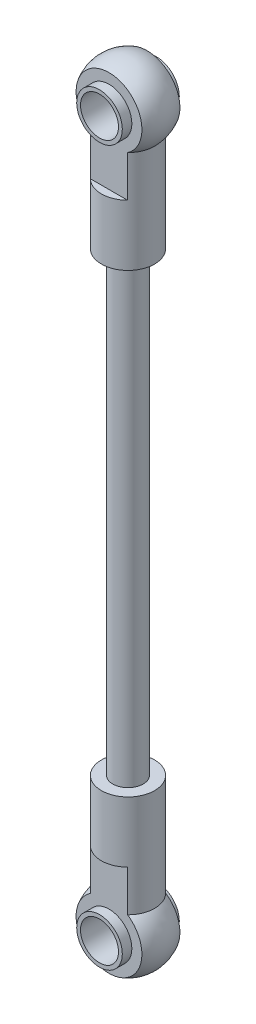
ISO-10303-21;
HEADER;
FILE_DESCRIPTION(('STEP AP214'),'2;1');
FILE_NAME('part.step','',(''),(''),'','','');
FILE_SCHEMA(('AUTOMOTIVE_DESIGN { 1 0 10303 214 1 1 1 1 }'));
ENDSEC;
DATA;
#1=APPLICATION_CONTEXT('core data for automotive mechanical design processes');
#2=APPLICATION_PROTOCOL_DEFINITION('international standard','automotive_design',2000,#1);
#3=PRODUCT_CONTEXT('',#1,'mechanical');
#4=PRODUCT('Part','Part','',(#3));
#5=PRODUCT_RELATED_PRODUCT_CATEGORY('part','',(#4));
#6=PRODUCT_DEFINITION_FORMATION('','',#4);
#7=PRODUCT_DEFINITION_CONTEXT('part definition',#1,'design');
#8=PRODUCT_DEFINITION('design','',#6,#7);
#9=PRODUCT_DEFINITION_SHAPE('','',#8);
#10=(LENGTH_UNIT() NAMED_UNIT(*) SI_UNIT(.MILLI.,.METRE.));
#11=(NAMED_UNIT(*) PLANE_ANGLE_UNIT() SI_UNIT($,.RADIAN.));
#12=(NAMED_UNIT(*) SI_UNIT($,.STERADIAN.) SOLID_ANGLE_UNIT());
#13=UNCERTAINTY_MEASURE_WITH_UNIT(LENGTH_MEASURE(1.E-05),#10,'distance_accuracy_value','');
#14=(GEOMETRIC_REPRESENTATION_CONTEXT(3) GLOBAL_UNCERTAINTY_ASSIGNED_CONTEXT((#13)) GLOBAL_UNIT_ASSIGNED_CONTEXT((#10,
#11,#12)) REPRESENTATION_CONTEXT('',''));
#15=CARTESIAN_POINT('',(0.,0.,0.));
#16=DIRECTION('',(0.,0.,1.));
#17=DIRECTION('',(1.,0.,0.));
#18=AXIS2_PLACEMENT_3D('',#15,#16,#17);
#19=CARTESIAN_POINT('',(0.,0.,2.5));
#20=DIRECTION('',(0.,0.,-1.));
#21=DIRECTION('',(-1.,0.,0.));
#22=AXIS2_PLACEMENT_3D('',#19,#20,#21);
#23=PLANE('',#22);
#24=CARTESIAN_POINT('',(0.,0.,2.5));
#25=DIRECTION('',(0.,0.,-1.));
#26=DIRECTION('',(-1.,0.,0.));
#27=AXIS2_PLACEMENT_3D('',#24,#25,#26);
#28=CIRCLE('',#27,4.33012701892219);
#29=CARTESIAN_POINT('',(-2.44948974278318,-3.57071421427142,2.5));
#30=VERTEX_POINT('',#29);
#31=CARTESIAN_POINT('',(2.44948974278318,-3.57071421427142,2.5));
#32=VERTEX_POINT('',#31);
#33=EDGE_CURVE('E65',#30,#32,#28,.T.);
#34=ORIENTED_EDGE('',*,*,#33,.F.);
#35=DIRECTION('',(0.,-1.,0.));
#36=VECTOR('',#35,1.);
#37=CARTESIAN_POINT('',(-2.44948974278318,0.,2.5));
#38=LINE('',#37,#36);
#39=CARTESIAN_POINT('',(-2.44948974278318,-9.,2.5));
#40=VERTEX_POINT('',#39);
#41=EDGE_CURVE('E203',#40,#30,#38,.F.);
#42=ORIENTED_EDGE('',*,*,#41,.F.);
#43=DIRECTION('',(1.,0.,0.));
#44=VECTOR('',#43,1.);
#45=CARTESIAN_POINT('',(-6.,-9.,2.5));
#46=LINE('',#45,#44);
#47=CARTESIAN_POINT('',(2.44948974278318,-9.,2.5));
#48=VERTEX_POINT('',#47);
#49=EDGE_CURVE('E200',#40,#48,#46,.T.);
#50=ORIENTED_EDGE('',*,*,#49,.T.);
#51=DIRECTION('',(0.,-1.,0.));
#52=VECTOR('',#51,1.);
#53=CARTESIAN_POINT('',(2.44948974278318,0.,2.5));
#54=LINE('',#53,#52);
#55=EDGE_CURVE('E206',#32,#48,#54,.T.);
#56=ORIENTED_EDGE('',*,*,#55,.F.);
#57=EDGE_LOOP('',(#34,#42,#50,#56));
#58=FACE_BOUND('',#57,.T.);
#59=CARTESIAN_POINT('',(0.,0.,2.5));
#60=DIRECTION('',(0.,0.,-1.));
#61=DIRECTION('',(-1.,0.,0.));
#62=AXIS2_PLACEMENT_3D('',#59,#60,#61);
#63=CIRCLE('',#62,3.);
#64=CARTESIAN_POINT('',(-3.,0.,2.5));
#65=VERTEX_POINT('',#64);
#66=EDGE_CURVE('E51',#65,#65,#63,.F.);
#67=ORIENTED_EDGE('',*,*,#66,.F.);
#68=EDGE_LOOP('',(#67));
#69=FACE_BOUND('',#68,.T.);
#70=ADVANCED_FACE('F42',(#58,#69),#23,.F.);
#71=CARTESIAN_POINT('',(0.,0.,-2.5));
#72=DIRECTION('',(0.,0.,1.));
#73=DIRECTION('',(-1.,0.,0.));
#74=AXIS2_PLACEMENT_3D('',#71,#72,#73);
#75=PLANE('',#74);
#76=CARTESIAN_POINT('',(0.,0.,-2.5));
#77=DIRECTION('',(0.,0.,1.));
#78=DIRECTION('',(1.,0.,0.));
#79=AXIS2_PLACEMENT_3D('',#76,#77,#78);
#80=CIRCLE('',#79,4.33012701892219);
#81=CARTESIAN_POINT('',(2.44948974278318,-3.57071421427142,-2.5));
#82=VERTEX_POINT('',#81);
#83=CARTESIAN_POINT('',(-2.44948974278318,-3.57071421427142,-2.5));
#84=VERTEX_POINT('',#83);
#85=EDGE_CURVE('E192',#82,#84,#80,.T.);
#86=ORIENTED_EDGE('',*,*,#85,.F.);
#87=DIRECTION('',(0.,-1.,0.));
#88=VECTOR('',#87,1.);
#89=CARTESIAN_POINT('',(2.44948974278318,0.,-2.5));
#90=LINE('',#89,#88);
#91=CARTESIAN_POINT('',(2.44948974278318,-9.,-2.5));
#92=VERTEX_POINT('',#91);
#93=EDGE_CURVE('E189',#92,#82,#90,.F.);
#94=ORIENTED_EDGE('',*,*,#93,.F.);
#95=DIRECTION('',(1.,0.,0.));
#96=VECTOR('',#95,1.);
#97=CARTESIAN_POINT('',(-6.,-9.,-2.5));
#98=LINE('',#97,#96);
#99=CARTESIAN_POINT('',(-2.44948974278318,-9.,-2.5));
#100=VERTEX_POINT('',#99);
#101=EDGE_CURVE('E57',#100,#92,#98,.T.);
#102=ORIENTED_EDGE('',*,*,#101,.F.);
#103=DIRECTION('',(0.,-1.,0.));
#104=VECTOR('',#103,1.);
#105=CARTESIAN_POINT('',(-2.44948974278318,0.,-2.5));
#106=LINE('',#105,#104);
#107=EDGE_CURVE('E195',#84,#100,#106,.T.);
#108=ORIENTED_EDGE('',*,*,#107,.F.);
#109=EDGE_LOOP('',(#86,#94,#102,#108));
#110=FACE_BOUND('',#109,.T.);
#111=CARTESIAN_POINT('',(0.,0.,-2.5));
#112=DIRECTION('',(0.,0.,1.));
#113=DIRECTION('',(1.,0.,0.));
#114=AXIS2_PLACEMENT_3D('',#111,#112,#113);
#115=CIRCLE('',#114,3.);
#116=CARTESIAN_POINT('',(3.,0.,-2.5));
#117=VERTEX_POINT('',#116);
#118=EDGE_CURVE('E185',#117,#117,#115,.F.);
#119=ORIENTED_EDGE('',*,*,#118,.F.);
#120=EDGE_LOOP('',(#119));
#121=FACE_BOUND('',#120,.T.);
#122=ADVANCED_FACE('F223',(#110,#121),#75,.F.);
#123=CARTESIAN_POINT('',(0.,0.,0.));
#124=DIRECTION('',(0.,-1.,0.));
#125=DIRECTION('',(1.,0.,0.));
#126=AXIS2_PLACEMENT_3D('',#123,#124,#125);
#127=SPHERICAL_SURFACE('',#126,5.);
#128=ORIENTED_EDGE('',*,*,#85,.T.);
#129=CARTESIAN_POINT('',(0.,-3.57071421427142,0.));
#130=DIRECTION('',(0.,-1.,0.));
#131=DIRECTION('',(0.,0.,-1.));
#132=AXIS2_PLACEMENT_3D('',#129,#130,#131);
#133=CIRCLE('',#132,3.5);
#134=EDGE_CURVE('E210',#30,#84,#133,.T.);
#135=ORIENTED_EDGE('',*,*,#134,.F.);
#136=ORIENTED_EDGE('',*,*,#33,.T.);
#137=EDGE_CURVE('E209',#82,#32,#133,.T.);
#138=ORIENTED_EDGE('',*,*,#137,.F.);
#139=EDGE_LOOP('',(#128,#135,#136,#138));
#140=FACE_BOUND('',#139,.T.);
#141=ADVANCED_FACE('F44',(#140),#127,.T.);
#142=CARTESIAN_POINT('',(1.75,-17.,0.));
#143=DIRECTION('',(0.,-1.,0.));
#144=DIRECTION('',(0.,0.,-1.));
#145=AXIS2_PLACEMENT_3D('',#142,#143,#144);
#146=PLANE('',#145);
#147=CARTESIAN_POINT('',(0.,-17.,0.));
#148=DIRECTION('',(0.,-1.,0.));
#149=DIRECTION('',(0.,0.,-1.));
#150=AXIS2_PLACEMENT_3D('',#147,#148,#149);
#151=CIRCLE('',#150,2.);
#152=CARTESIAN_POINT('',(0.,-17.,-2.));
#153=VERTEX_POINT('',#152);
#154=EDGE_CURVE('E165',#153,#153,#151,.T.);
#155=ORIENTED_EDGE('',*,*,#154,.F.);
#156=EDGE_LOOP('',(#155));
#157=FACE_BOUND('',#156,.T.);
#158=CARTESIAN_POINT('',(0.,-17.,0.));
#159=DIRECTION('',(0.,-1.,0.));
#160=DIRECTION('',(0.,0.,-1.));
#161=AXIS2_PLACEMENT_3D('',#158,#159,#160);
#162=CIRCLE('',#161,3.5);
#163=CARTESIAN_POINT('',(0.,-17.,-3.5));
#164=VERTEX_POINT('',#163);
#165=EDGE_CURVE('E213',#164,#164,#162,.T.);
#166=ORIENTED_EDGE('',*,*,#165,.T.);
#167=EDGE_LOOP('',(#166));
#168=FACE_BOUND('',#167,.T.);
#169=ADVANCED_FACE('F231',(#157,#168),#146,.T.);
#170=CARTESIAN_POINT('',(0.,0.,0.));
#171=DIRECTION('',(0.,-1.,0.));
#172=DIRECTION('',(0.,0.,-1.));
#173=AXIS2_PLACEMENT_3D('',#170,#171,#172);
#174=CYLINDRICAL_SURFACE('',#173,3.5);
#175=ORIENTED_EDGE('',*,*,#107,.T.);
#176=CARTESIAN_POINT('',(0.,-9.,0.));
#177=DIRECTION('',(0.,-1.,0.));
#178=DIRECTION('',(0.,0.,-1.));
#179=AXIS2_PLACEMENT_3D('',#176,#177,#178);
#180=CIRCLE('',#179,3.5);
#181=EDGE_CURVE('E180',#100,#92,#180,.T.);
#182=ORIENTED_EDGE('',*,*,#181,.T.);
#183=ORIENTED_EDGE('',*,*,#93,.T.);
#184=ORIENTED_EDGE('',*,*,#137,.T.);
#185=ORIENTED_EDGE('',*,*,#55,.T.);
#186=CARTESIAN_POINT('',(0.,-9.,0.));
#187=DIRECTION('',(0.,1.,0.));
#188=DIRECTION('',(0.,0.,1.));
#189=AXIS2_PLACEMENT_3D('',#186,#187,#188);
#190=CIRCLE('',#189,3.5);
#191=EDGE_CURVE('E198',#40,#48,#190,.T.);
#192=ORIENTED_EDGE('',*,*,#191,.F.);
#193=ORIENTED_EDGE('',*,*,#41,.T.);
#194=ORIENTED_EDGE('',*,*,#134,.T.);
#195=EDGE_LOOP('',(#175,#182,#183,#184,#185,#192,#193,#194));
#196=FACE_BOUND('',#195,.T.);
#197=ORIENTED_EDGE('',*,*,#165,.F.);
#198=EDGE_LOOP('',(#197));
#199=FACE_BOUND('',#198,.T.);
#200=ADVANCED_FACE('F244',(#196,#199),#174,.T.);
#201=CARTESIAN_POINT('',(-6.,-9.,4.33112701892219));
#202=DIRECTION('',(0.,1.,0.));
#203=DIRECTION('',(0.,0.,1.));
#204=AXIS2_PLACEMENT_3D('',#201,#202,#203);
#205=PLANE('',#204);
#206=ORIENTED_EDGE('',*,*,#191,.T.);
#207=ORIENTED_EDGE('',*,*,#49,.F.);
#208=EDGE_LOOP('',(#206,#207));
#209=FACE_BOUND('',#208,.T.);
#210=ADVANCED_FACE('F240',(#209),#205,.T.);
#211=CARTESIAN_POINT('',(-6.,-9.,-4.33112701892219));
#212=DIRECTION('',(0.,-1.,0.));
#213=DIRECTION('',(0.,0.,-1.));
#214=AXIS2_PLACEMENT_3D('',#211,#212,#213);
#215=PLANE('',#214);
#216=ORIENTED_EDGE('',*,*,#101,.T.);
#217=ORIENTED_EDGE('',*,*,#181,.F.);
#218=EDGE_LOOP('',(#216,#217));
#219=FACE_BOUND('',#218,.T.);
#220=ADVANCED_FACE('F238',(#219),#215,.F.);
#221=CARTESIAN_POINT('',(0.,0.,3.75));
#222=DIRECTION('',(0.,0.,-1.));
#223=DIRECTION('',(-1.,0.,0.));
#224=AXIS2_PLACEMENT_3D('',#221,#222,#223);
#225=CYLINDRICAL_SURFACE('',#224,3.);
#226=CARTESIAN_POINT('',(0.,0.,-3.75));
#227=DIRECTION('',(0.,0.,1.));
#228=DIRECTION('',(1.,0.,0.));
#229=AXIS2_PLACEMENT_3D('',#226,#227,#228);
#230=CIRCLE('',#229,3.);
#231=CARTESIAN_POINT('',(3.,0.,-3.75));
#232=VERTEX_POINT('',#231);
#233=EDGE_CURVE('E174',#232,#232,#230,.T.);
#234=ORIENTED_EDGE('',*,*,#233,.T.);
#235=EDGE_LOOP('',(#234));
#236=FACE_BOUND('',#235,.T.);
#237=ORIENTED_EDGE('',*,*,#118,.T.);
#238=EDGE_LOOP('',(#237));
#239=FACE_BOUND('',#238,.T.);
#240=ADVANCED_FACE('F221',(#236,#239),#225,.T.);
#241=CARTESIAN_POINT('',(0.,0.,-3.75));
#242=DIRECTION('',(0.,0.,1.));
#243=DIRECTION('',(1.,0.,0.));
#244=AXIS2_PLACEMENT_3D('',#241,#242,#243);
#245=PLANE('',#244);
#246=ORIENTED_EDGE('',*,*,#233,.F.);
#247=EDGE_LOOP('',(#246));
#248=FACE_BOUND('',#247,.T.);
#249=CARTESIAN_POINT('',(0.,0.,-3.75));
#250=DIRECTION('',(0.,0.,1.));
#251=DIRECTION('',(1.,0.,0.));
#252=AXIS2_PLACEMENT_3D('',#249,#250,#251);
#253=CIRCLE('',#252,2.5);
#254=CARTESIAN_POINT('',(2.5,0.,-3.75));
#255=VERTEX_POINT('',#254);
#256=EDGE_CURVE('E170',#255,#255,#253,.T.);
#257=ORIENTED_EDGE('',*,*,#256,.T.);
#258=EDGE_LOOP('',(#257));
#259=FACE_BOUND('',#258,.T.);
#260=ADVANCED_FACE('F249',(#248,#259),#245,.F.);
#261=CARTESIAN_POINT('',(0.,0.,-5.));
#262=DIRECTION('',(0.,0.,1.));
#263=DIRECTION('',(1.,0.,0.));
#264=AXIS2_PLACEMENT_3D('',#261,#262,#263);
#265=CYLINDRICAL_SURFACE('',#264,2.5);
#266=ORIENTED_EDGE('',*,*,#256,.F.);
#267=EDGE_LOOP('',(#266));
#268=FACE_BOUND('',#267,.T.);
#269=CARTESIAN_POINT('',(0.,0.,3.75));
#270=DIRECTION('',(0.,0.,1.));
#271=DIRECTION('',(1.,0.,0.));
#272=AXIS2_PLACEMENT_3D('',#269,#270,#271);
#273=CIRCLE('',#272,2.5);
#274=CARTESIAN_POINT('',(2.5,0.,3.75));
#275=VERTEX_POINT('',#274);
#276=EDGE_CURVE('E171',#275,#275,#273,.T.);
#277=ORIENTED_EDGE('',*,*,#276,.T.);
#278=EDGE_LOOP('',(#277));
#279=FACE_BOUND('',#278,.T.);
#280=ADVANCED_FACE('F246',(#268,#279),#265,.F.);
#281=CARTESIAN_POINT('',(0.,0.,3.75));
#282=DIRECTION('',(0.,0.,1.));
#283=DIRECTION('',(1.,0.,0.));
#284=AXIS2_PLACEMENT_3D('',#281,#282,#283);
#285=CIRCLE('',#284,3.);
#286=CARTESIAN_POINT('',(3.,0.,3.75));
#287=VERTEX_POINT('',#286);
#288=EDGE_CURVE('E177',#287,#287,#285,.T.);
#289=ORIENTED_EDGE('',*,*,#288,.F.);
#290=EDGE_LOOP('',(#289));
#291=FACE_BOUND('',#290,.T.);
#292=ORIENTED_EDGE('',*,*,#66,.T.);
#293=EDGE_LOOP('',(#292));
#294=FACE_BOUND('',#293,.T.);
#295=ADVANCED_FACE('F236',(#291,#294),#225,.T.);
#296=CARTESIAN_POINT('',(0.,0.,3.75));
#297=DIRECTION('',(0.,0.,1.));
#298=DIRECTION('',(1.,0.,0.));
#299=AXIS2_PLACEMENT_3D('',#296,#297,#298);
#300=PLANE('',#299);
#301=ORIENTED_EDGE('',*,*,#288,.T.);
#302=EDGE_LOOP('',(#301));
#303=FACE_BOUND('',#302,.T.);
#304=ORIENTED_EDGE('',*,*,#276,.F.);
#305=EDGE_LOOP('',(#304));
#306=FACE_BOUND('',#305,.T.);
#307=ADVANCED_FACE('F298',(#303,#306),#300,.T.);
#308=CARTESIAN_POINT('',(0.,-77.,0.));
#309=DIRECTION('',(0.,1.,0.));
#310=DIRECTION('',(0.,0.,1.));
#311=AXIS2_PLACEMENT_3D('',#308,#309,#310);
#312=CYLINDRICAL_SURFACE('',#311,2.);
#313=CARTESIAN_POINT('',(0.,-77.,0.));
#314=DIRECTION('',(0.,-1.,0.));
#315=DIRECTION('',(0.,0.,-1.));
#316=AXIS2_PLACEMENT_3D('',#313,#314,#315);
#317=CIRCLE('',#316,2.);
#318=CARTESIAN_POINT('',(0.,-77.,-2.));
#319=VERTEX_POINT('',#318);
#320=EDGE_CURVE('E161',#319,#319,#317,.T.);
#321=ORIENTED_EDGE('',*,*,#320,.F.);
#322=EDGE_LOOP('',(#321));
#323=FACE_BOUND('',#322,.T.);
#324=ORIENTED_EDGE('',*,*,#154,.T.);
#325=EDGE_LOOP('',(#324));
#326=FACE_BOUND('',#325,.T.);
#327=ADVANCED_FACE('F294',(#323,#326),#312,.T.);
#328=CARTESIAN_POINT('',(0.,-94.,3.75));
#329=DIRECTION('',(0.,0.,1.));
#330=DIRECTION('',(1.,0.,0.));
#331=AXIS2_PLACEMENT_3D('',#328,#329,#330);
#332=PLANE('',#331);
#333=CARTESIAN_POINT('',(0.,-94.,3.75));
#334=DIRECTION('',(0.,0.,-1.));
#335=DIRECTION('',(1.,0.,0.));
#336=AXIS2_PLACEMENT_3D('',#333,#334,#335);
#337=CIRCLE('',#336,3.);
#338=CARTESIAN_POINT('',(3.,-94.,3.75));
#339=VERTEX_POINT('',#338);
#340=EDGE_CURVE('E548',#339,#339,#337,.T.);
#341=ORIENTED_EDGE('',*,*,#340,.F.);
#342=EDGE_LOOP('',(#341));
#343=FACE_BOUND('',#342,.T.);
#344=CARTESIAN_POINT('',(0.,-94.,3.75));
#345=DIRECTION('',(0.,0.,-1.));
#346=DIRECTION('',(1.,0.,0.));
#347=AXIS2_PLACEMENT_3D('',#344,#345,#346);
#348=CIRCLE('',#347,2.5);
#349=CARTESIAN_POINT('',(2.5,-94.,3.75));
#350=VERTEX_POINT('',#349);
#351=EDGE_CURVE('E554',#350,#350,#348,.T.);
#352=ORIENTED_EDGE('',*,*,#351,.T.);
#353=EDGE_LOOP('',(#352));
#354=FACE_BOUND('',#353,.T.);
#355=ADVANCED_FACE('F297',(#343,#354),#332,.T.);
#356=CARTESIAN_POINT('',(0.,-94.,3.75));
#357=DIRECTION('',(0.,0.,-1.));
#358=DIRECTION('',(-1.,0.,0.));
#359=AXIS2_PLACEMENT_3D('',#356,#357,#358);
#360=CYLINDRICAL_SURFACE('',#359,3.);
#361=ORIENTED_EDGE('',*,*,#340,.T.);
#362=EDGE_LOOP('',(#361));
#363=FACE_BOUND('',#362,.T.);
#364=CARTESIAN_POINT('',(0.,-94.,2.5));
#365=DIRECTION('',(0.,0.,1.));
#366=DIRECTION('',(-1.,0.,0.));
#367=AXIS2_PLACEMENT_3D('',#364,#365,#366);
#368=CIRCLE('',#367,3.);
#369=CARTESIAN_POINT('',(-3.,-94.,2.5));
#370=VERTEX_POINT('',#369);
#371=EDGE_CURVE('E160',#370,#370,#368,.F.);
#372=ORIENTED_EDGE('',*,*,#371,.F.);
#373=EDGE_LOOP('',(#372));
#374=FACE_BOUND('',#373,.T.);
#375=ADVANCED_FACE('F341',(#363,#374),#360,.T.);
#376=CARTESIAN_POINT('',(0.,-94.,-5.));
#377=DIRECTION('',(0.,0.,1.));
#378=DIRECTION('',(1.,0.,0.));
#379=AXIS2_PLACEMENT_3D('',#376,#377,#378);
#380=CYLINDRICAL_SURFACE('',#379,2.5);
#381=CARTESIAN_POINT('',(0.,-94.,-3.75));
#382=DIRECTION('',(0.,0.,-1.));
#383=DIRECTION('',(1.,0.,0.));
#384=AXIS2_PLACEMENT_3D('',#381,#382,#383);
#385=CIRCLE('',#384,2.5);
#386=CARTESIAN_POINT('',(2.5,-94.,-3.75));
#387=VERTEX_POINT('',#386);
#388=EDGE_CURVE('E556',#387,#387,#385,.T.);
#389=ORIENTED_EDGE('',*,*,#388,.T.);
#390=EDGE_LOOP('',(#389));
#391=FACE_BOUND('',#390,.T.);
#392=ORIENTED_EDGE('',*,*,#351,.F.);
#393=EDGE_LOOP('',(#392));
#394=FACE_BOUND('',#393,.T.);
#395=ADVANCED_FACE('F349',(#391,#394),#380,.F.);
#396=CARTESIAN_POINT('',(0.,-94.,-3.75));
#397=DIRECTION('',(0.,0.,1.));
#398=DIRECTION('',(1.,0.,0.));
#399=AXIS2_PLACEMENT_3D('',#396,#397,#398);
#400=PLANE('',#399);
#401=CARTESIAN_POINT('',(0.,-94.,-3.75));
#402=DIRECTION('',(0.,0.,-1.));
#403=DIRECTION('',(1.,0.,0.));
#404=AXIS2_PLACEMENT_3D('',#401,#402,#403);
#405=CIRCLE('',#404,3.);
#406=CARTESIAN_POINT('',(3.,-94.,-3.75));
#407=VERTEX_POINT('',#406);
#408=EDGE_CURVE('E546',#407,#407,#405,.T.);
#409=ORIENTED_EDGE('',*,*,#408,.T.);
#410=EDGE_LOOP('',(#409));
#411=FACE_BOUND('',#410,.T.);
#412=ORIENTED_EDGE('',*,*,#388,.F.);
#413=EDGE_LOOP('',(#412));
#414=FACE_BOUND('',#413,.T.);
#415=ADVANCED_FACE('F358',(#411,#414),#400,.F.);
#416=ORIENTED_EDGE('',*,*,#408,.F.);
#417=EDGE_LOOP('',(#416));
#418=FACE_BOUND('',#417,.T.);
#419=CARTESIAN_POINT('',(0.,-94.,-2.5));
#420=DIRECTION('',(0.,0.,-1.));
#421=DIRECTION('',(1.,0.,0.));
#422=AXIS2_PLACEMENT_3D('',#419,#420,#421);
#423=CIRCLE('',#422,3.);
#424=CARTESIAN_POINT('',(3.,-94.,-2.5));
#425=VERTEX_POINT('',#424);
#426=EDGE_CURVE('E157',#425,#425,#423,.F.);
#427=ORIENTED_EDGE('',*,*,#426,.F.);
#428=EDGE_LOOP('',(#427));
#429=FACE_BOUND('',#428,.T.);
#430=ADVANCED_FACE('F352',(#418,#429),#360,.T.);
#431=CARTESIAN_POINT('',(-6.,-85.,-4.33112701892219));
#432=DIRECTION('',(0.,1.,0.));
#433=DIRECTION('',(0.,0.,-1.));
#434=AXIS2_PLACEMENT_3D('',#431,#432,#433);
#435=PLANE('',#434);
#436=DIRECTION('',(1.,0.,0.));
#437=VECTOR('',#436,1.);
#438=CARTESIAN_POINT('',(-6.,-85.,-2.5));
#439=LINE('',#438,#437);
#440=CARTESIAN_POINT('',(-2.44948974278318,-85.,-2.5));
#441=VERTEX_POINT('',#440);
#442=CARTESIAN_POINT('',(2.44948974278318,-85.,-2.5));
#443=VERTEX_POINT('',#442);
#444=EDGE_CURVE('E138',#441,#443,#439,.T.);
#445=ORIENTED_EDGE('',*,*,#444,.F.);
#446=CARTESIAN_POINT('',(0.,-85.,0.));
#447=DIRECTION('',(0.,-1.,0.));
#448=DIRECTION('',(0.,0.,-1.));
#449=AXIS2_PLACEMENT_3D('',#446,#447,#448);
#450=CIRCLE('',#449,3.5);
#451=EDGE_CURVE('E127',#441,#443,#450,.T.);
#452=ORIENTED_EDGE('',*,*,#451,.T.);
#453=EDGE_LOOP('',(#445,#452));
#454=FACE_BOUND('',#453,.T.);
#455=ADVANCED_FACE('F373',(#454),#435,.F.);
#456=CARTESIAN_POINT('',(-6.,-85.,4.33112701892219));
#457=DIRECTION('',(0.,-1.,0.));
#458=DIRECTION('',(0.,0.,1.));
#459=AXIS2_PLACEMENT_3D('',#456,#457,#458);
#460=PLANE('',#459);
#461=CARTESIAN_POINT('',(0.,-85.,0.));
#462=DIRECTION('',(0.,1.,0.));
#463=DIRECTION('',(0.,0.,1.));
#464=AXIS2_PLACEMENT_3D('',#461,#462,#463);
#465=CIRCLE('',#464,3.5);
#466=CARTESIAN_POINT('',(-2.44948974278318,-85.,2.5));
#467=VERTEX_POINT('',#466);
#468=CARTESIAN_POINT('',(2.44948974278318,-85.,2.5));
#469=VERTEX_POINT('',#468);
#470=EDGE_CURVE('E131',#467,#469,#465,.T.);
#471=ORIENTED_EDGE('',*,*,#470,.F.);
#472=DIRECTION('',(1.,0.,0.));
#473=VECTOR('',#472,1.);
#474=CARTESIAN_POINT('',(-6.,-85.,2.5));
#475=LINE('',#474,#473);
#476=EDGE_CURVE('E143',#467,#469,#475,.T.);
#477=ORIENTED_EDGE('',*,*,#476,.T.);
#478=EDGE_LOOP('',(#471,#477));
#479=FACE_BOUND('',#478,.T.);
#480=ADVANCED_FACE('F380',(#479),#460,.T.);
#481=CARTESIAN_POINT('',(0.,-94.,0.));
#482=DIRECTION('',(0.,1.,0.));
#483=DIRECTION('',(0.,0.,-1.));
#484=AXIS2_PLACEMENT_3D('',#481,#482,#483);
#485=CYLINDRICAL_SURFACE('',#484,3.5);
#486=DIRECTION('',(0.,1.,0.));
#487=VECTOR('',#486,1.);
#488=CARTESIAN_POINT('',(-2.44948974278318,-94.,-2.5));
#489=LINE('',#488,#487);
#490=CARTESIAN_POINT('',(-2.44948974278318,-90.4292857857286,-2.5));
#491=VERTEX_POINT('',#490);
#492=EDGE_CURVE('E123',#491,#441,#489,.T.);
#493=ORIENTED_EDGE('',*,*,#492,.F.);
#494=CARTESIAN_POINT('',(0.,-90.4292857857286,0.));
#495=DIRECTION('',(0.,-1.,0.));
#496=DIRECTION('',(0.,0.,-1.));
#497=AXIS2_PLACEMENT_3D('',#494,#495,#496);
#498=CIRCLE('',#497,3.5);
#499=CARTESIAN_POINT('',(-2.44948974278318,-90.4292857857286,2.5));
#500=VERTEX_POINT('',#499);
#501=EDGE_CURVE('E109',#500,#491,#498,.T.);
#502=ORIENTED_EDGE('',*,*,#501,.F.);
#503=DIRECTION('',(0.,1.,0.));
#504=VECTOR('',#503,1.);
#505=CARTESIAN_POINT('',(-2.44948974278318,-94.,2.5));
#506=LINE('',#505,#504);
#507=EDGE_CURVE('E146',#467,#500,#506,.F.);
#508=ORIENTED_EDGE('',*,*,#507,.F.);
#509=ORIENTED_EDGE('',*,*,#470,.T.);
#510=DIRECTION('',(0.,1.,0.));
#511=VECTOR('',#510,1.);
#512=CARTESIAN_POINT('',(2.44948974278318,-94.,2.5));
#513=LINE('',#512,#511);
#514=CARTESIAN_POINT('',(2.44948974278318,-90.4292857857286,2.5));
#515=VERTEX_POINT('',#514);
#516=EDGE_CURVE('E149',#515,#469,#513,.T.);
#517=ORIENTED_EDGE('',*,*,#516,.F.);
#518=CARTESIAN_POINT('',(2.44948974278318,-90.4292857857286,-2.5));
#519=VERTEX_POINT('',#518);
#520=EDGE_CURVE('E120',#519,#515,#498,.T.);
#521=ORIENTED_EDGE('',*,*,#520,.F.);
#522=DIRECTION('',(0.,1.,0.));
#523=VECTOR('',#522,1.);
#524=CARTESIAN_POINT('',(2.44948974278318,-94.,-2.5));
#525=LINE('',#524,#523);
#526=EDGE_CURVE('E136',#443,#519,#525,.F.);
#527=ORIENTED_EDGE('',*,*,#526,.F.);
#528=ORIENTED_EDGE('',*,*,#451,.F.);
#529=EDGE_LOOP('',(#493,#502,#508,#509,#517,#521,#527,#528));
#530=FACE_BOUND('',#529,.T.);
#531=CARTESIAN_POINT('',(0.,-77.,0.));
#532=DIRECTION('',(0.,-1.,0.));
#533=DIRECTION('',(0.,0.,-1.));
#534=AXIS2_PLACEMENT_3D('',#531,#532,#533);
#535=CIRCLE('',#534,3.5);
#536=CARTESIAN_POINT('',(0.,-77.,-3.5));
#537=VERTEX_POINT('',#536);
#538=EDGE_CURVE('E119',#537,#537,#535,.T.);
#539=ORIENTED_EDGE('',*,*,#538,.T.);
#540=EDGE_LOOP('',(#539));
#541=FACE_BOUND('',#540,.T.);
#542=ADVANCED_FACE('F124',(#530,#541),#485,.T.);
#543=CARTESIAN_POINT('',(1.75,-77.,0.));
#544=DIRECTION('',(0.,1.,0.));
#545=DIRECTION('',(0.,0.,-1.));
#546=AXIS2_PLACEMENT_3D('',#543,#544,#545);
#547=PLANE('',#546);
#548=ORIENTED_EDGE('',*,*,#320,.T.);
#549=EDGE_LOOP('',(#548));
#550=FACE_BOUND('',#549,.T.);
#551=ORIENTED_EDGE('',*,*,#538,.F.);
#552=EDGE_LOOP('',(#551));
#553=FACE_BOUND('',#552,.T.);
#554=ADVANCED_FACE('F288',(#550,#553),#547,.T.);
#555=CARTESIAN_POINT('',(0.,-94.,0.));
#556=DIRECTION('',(0.,1.,0.));
#557=DIRECTION('',(1.,0.,0.));
#558=AXIS2_PLACEMENT_3D('',#555,#556,#557);
#559=SPHERICAL_SURFACE('',#558,5.);
#560=CARTESIAN_POINT('',(0.,-94.,-2.5));
#561=DIRECTION('',(0.,0.,-1.));
#562=DIRECTION('',(1.,0.,0.));
#563=AXIS2_PLACEMENT_3D('',#560,#561,#562);
#564=CIRCLE('',#563,4.33012701892219);
#565=EDGE_CURVE('E113',#519,#491,#564,.T.);
#566=ORIENTED_EDGE('',*,*,#565,.F.);
#567=ORIENTED_EDGE('',*,*,#520,.T.);
#568=CARTESIAN_POINT('',(0.,-94.,2.5));
#569=DIRECTION('',(0.,0.,1.));
#570=DIRECTION('',(-1.,0.,0.));
#571=AXIS2_PLACEMENT_3D('',#568,#569,#570);
#572=CIRCLE('',#571,4.33012701892219);
#573=EDGE_CURVE('E115',#500,#515,#572,.T.);
#574=ORIENTED_EDGE('',*,*,#573,.F.);
#575=ORIENTED_EDGE('',*,*,#501,.T.);
#576=EDGE_LOOP('',(#566,#567,#574,#575));
#577=FACE_BOUND('',#576,.T.);
#578=ADVANCED_FACE('F111',(#577),#559,.T.);
#579=CARTESIAN_POINT('',(0.,-94.,-2.5));
#580=DIRECTION('',(0.,0.,1.));
#581=DIRECTION('',(-1.,0.,0.));
#582=AXIS2_PLACEMENT_3D('',#579,#580,#581);
#583=PLANE('',#582);
#584=ORIENTED_EDGE('',*,*,#565,.T.);
#585=ORIENTED_EDGE('',*,*,#492,.T.);
#586=ORIENTED_EDGE('',*,*,#444,.T.);
#587=ORIENTED_EDGE('',*,*,#526,.T.);
#588=EDGE_LOOP('',(#584,#585,#586,#587));
#589=FACE_BOUND('',#588,.T.);
#590=ORIENTED_EDGE('',*,*,#426,.T.);
#591=EDGE_LOOP('',(#590));
#592=FACE_BOUND('',#591,.T.);
#593=ADVANCED_FACE('F134',(#589,#592),#583,.F.);
#594=CARTESIAN_POINT('',(0.,-94.,2.5));
#595=DIRECTION('',(0.,0.,-1.));
#596=DIRECTION('',(-1.,0.,0.));
#597=AXIS2_PLACEMENT_3D('',#594,#595,#596);
#598=PLANE('',#597);
#599=ORIENTED_EDGE('',*,*,#573,.T.);
#600=ORIENTED_EDGE('',*,*,#516,.T.);
#601=ORIENTED_EDGE('',*,*,#476,.F.);
#602=ORIENTED_EDGE('',*,*,#507,.T.);
#603=EDGE_LOOP('',(#599,#600,#601,#602));
#604=FACE_BOUND('',#603,.T.);
#605=ORIENTED_EDGE('',*,*,#371,.T.);
#606=EDGE_LOOP('',(#605));
#607=FACE_BOUND('',#606,.T.);
#608=ADVANCED_FACE('F410',(#604,#607),#598,.F.);
#609=CLOSED_SHELL('',(#70,#122,#141,#169,#200,#210,#220,#240,#260,#280,#295,#307,#327,#355,#375,
#395,#415,#430,#455,#480,#542,#554,#578,#593,#608));
#610=CARTESIAN_POINT('',(0.,-7.,0.));
#611=DIRECTION('',(0.,-1.,0.));
#612=DIRECTION('',(0.,0.,-1.));
#613=AXIS2_PLACEMENT_3D('',#610,#611,#612);
#614=PLANE('',#613);
#615=CARTESIAN_POINT('',(0.,-7.,0.));
#616=DIRECTION('',(0.,-1.,0.));
#617=DIRECTION('',(0.,0.,-1.));
#618=AXIS2_PLACEMENT_3D('',#615,#616,#617);
#619=CIRCLE('',#618,1.75);
#620=CARTESIAN_POINT('',(0.,-7.,-1.75));
#621=VERTEX_POINT('',#620);
#622=EDGE_CURVE('E216',#621,#621,#619,.T.);
#623=ORIENTED_EDGE('',*,*,#622,.T.);
#624=EDGE_LOOP('',(#623));
#625=FACE_BOUND('',#624,.T.);
#626=ADVANCED_FACE('F260',(#625),#614,.T.);
#627=CARTESIAN_POINT('',(0.,0.,0.));
#628=DIRECTION('',(0.,-1.,0.));
#629=DIRECTION('',(0.,0.,-1.));
#630=AXIS2_PLACEMENT_3D('',#627,#628,#629);
#631=CYLINDRICAL_SURFACE('',#630,1.75);
#632=CARTESIAN_POINT('',(0.,-17.,0.));
#633=DIRECTION('',(0.,-1.,0.));
#634=DIRECTION('',(0.,0.,-1.));
#635=AXIS2_PLACEMENT_3D('',#632,#633,#634);
#636=CIRCLE('',#635,1.75);
#637=CARTESIAN_POINT('',(0.,-17.,-1.75));
#638=VERTEX_POINT('',#637);
#639=EDGE_CURVE('E164',#638,#638,#636,.T.);
#640=ORIENTED_EDGE('',*,*,#639,.T.);
#641=EDGE_LOOP('',(#640));
#642=FACE_BOUND('',#641,.T.);
#643=ORIENTED_EDGE('',*,*,#622,.F.);
#644=EDGE_LOOP('',(#643));
#645=FACE_BOUND('',#644,.T.);
#646=ADVANCED_FACE('F257',(#642,#645),#631,.F.);
#647=CARTESIAN_POINT('',(0.,-17.,0.));
#648=DIRECTION('',(0.,-1.,0.));
#649=DIRECTION('',(0.,0.,-1.));
#650=AXIS2_PLACEMENT_3D('',#647,#648,#649);
#651=PLANE('',#650);
#652=ORIENTED_EDGE('',*,*,#639,.F.);
#653=EDGE_LOOP('',(#652));
#654=FACE_BOUND('',#653,.T.);
#655=ADVANCED_FACE('F259',(#654),#651,.F.);
#656=CLOSED_SHELL('',(#626,#646,#655));
#657=CARTESIAN_POINT('',(0.,-87.,0.));
#658=DIRECTION('',(0.,1.,0.));
#659=DIRECTION('',(0.,0.,-1.));
#660=AXIS2_PLACEMENT_3D('',#657,#658,#659);
#661=PLANE('',#660);
#662=CARTESIAN_POINT('',(0.,-87.,0.));
#663=DIRECTION('',(0.,-1.,0.));
#664=DIRECTION('',(0.,0.,-1.));
#665=AXIS2_PLACEMENT_3D('',#662,#663,#664);
#666=CIRCLE('',#665,1.75);
#667=CARTESIAN_POINT('',(0.,-87.,-1.75));
#668=VERTEX_POINT('',#667);
#669=EDGE_CURVE('E154',#668,#668,#666,.T.);
#670=ORIENTED_EDGE('',*,*,#669,.F.);
#671=EDGE_LOOP('',(#670));
#672=FACE_BOUND('',#671,.T.);
#673=ADVANCED_FACE('F271',(#672),#661,.T.);
#674=CARTESIAN_POINT('',(0.,-94.,0.));
#675=DIRECTION('',(0.,1.,0.));
#676=DIRECTION('',(0.,0.,-1.));
#677=AXIS2_PLACEMENT_3D('',#674,#675,#676);
#678=CYLINDRICAL_SURFACE('',#677,1.75);
#679=CARTESIAN_POINT('',(0.,-77.,0.));
#680=DIRECTION('',(0.,-1.,0.));
#681=DIRECTION('',(0.,0.,-1.));
#682=AXIS2_PLACEMENT_3D('',#679,#680,#681);
#683=CIRCLE('',#682,1.75);
#684=CARTESIAN_POINT('',(0.,-77.,-1.75));
#685=VERTEX_POINT('',#684);
#686=EDGE_CURVE('E12',#685,#685,#683,.F.);
#687=ORIENTED_EDGE('',*,*,#686,.T.);
#688=EDGE_LOOP('',(#687));
#689=FACE_BOUND('',#688,.T.);
#690=ORIENTED_EDGE('',*,*,#669,.T.);
#691=EDGE_LOOP('',(#690));
#692=FACE_BOUND('',#691,.T.);
#693=ADVANCED_FACE('F273',(#689,#692),#678,.F.);
#694=CARTESIAN_POINT('',(0.,-77.,0.));
#695=DIRECTION('',(0.,-1.,0.));
#696=DIRECTION('',(0.,0.,-1.));
#697=AXIS2_PLACEMENT_3D('',#694,#695,#696);
#698=PLANE('',#697);
#699=ORIENTED_EDGE('',*,*,#686,.F.);
#700=EDGE_LOOP('',(#699));
#701=FACE_BOUND('',#700,.T.);
#702=ADVANCED_FACE('F280',(#701),#698,.T.);
#703=CLOSED_SHELL('',(#673,#693,#702));
#704=ORIENTED_CLOSED_SHELL('',*,#656,.T.);
#705=ORIENTED_CLOSED_SHELL('',*,#703,.T.);
#706=BREP_WITH_VOIDS('B2',#609,(#704,#705));
#707=ADVANCED_BREP_SHAPE_REPRESENTATION('',(#18,#706),#14);
#708=SHAPE_DEFINITION_REPRESENTATION(#9,#707);
ENDSEC;
END-ISO-10303-21;
